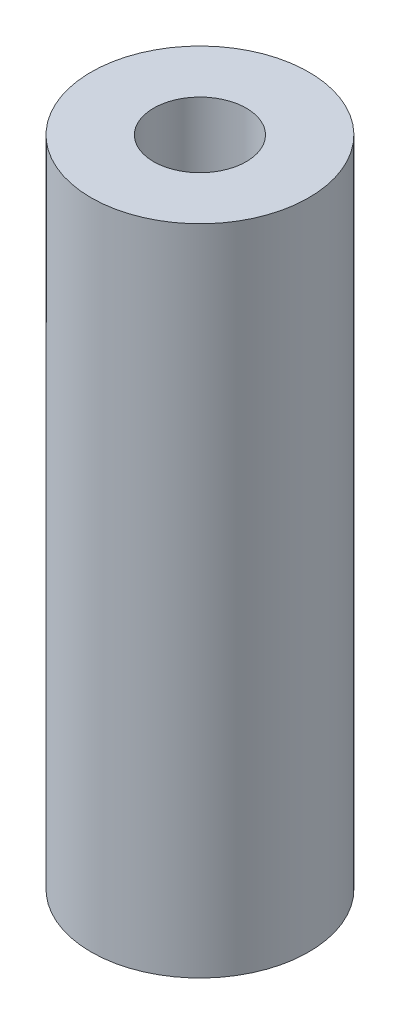
ISO-10303-21;
HEADER;
FILE_DESCRIPTION(('STEP AP214'),'2;1');
FILE_NAME('part.step','',(''),(''),'','','');
FILE_SCHEMA(('AUTOMOTIVE_DESIGN { 1 0 10303 214 1 1 1 1 }'));
ENDSEC;
DATA;
#1=APPLICATION_CONTEXT('core data for automotive mechanical design processes');
#2=APPLICATION_PROTOCOL_DEFINITION('international standard','automotive_design',2000,#1);
#3=PRODUCT_CONTEXT('',#1,'mechanical');
#4=PRODUCT('Part','Part','',(#3));
#5=PRODUCT_RELATED_PRODUCT_CATEGORY('part','',(#4));
#6=PRODUCT_DEFINITION_FORMATION('','',#4);
#7=PRODUCT_DEFINITION_CONTEXT('part definition',#1,'design');
#8=PRODUCT_DEFINITION('design','',#6,#7);
#9=PRODUCT_DEFINITION_SHAPE('','',#8);
#10=(LENGTH_UNIT() NAMED_UNIT(*) SI_UNIT(.MILLI.,.METRE.));
#11=(NAMED_UNIT(*) PLANE_ANGLE_UNIT() SI_UNIT($,.RADIAN.));
#12=(NAMED_UNIT(*) SI_UNIT($,.STERADIAN.) SOLID_ANGLE_UNIT());
#13=UNCERTAINTY_MEASURE_WITH_UNIT(LENGTH_MEASURE(1.E-05),#10,'distance_accuracy_value','');
#14=(GEOMETRIC_REPRESENTATION_CONTEXT(3) GLOBAL_UNCERTAINTY_ASSIGNED_CONTEXT((#13)) GLOBAL_UNIT_ASSIGNED_CONTEXT((#10,
#11,#12)) REPRESENTATION_CONTEXT('',''));
#15=CARTESIAN_POINT('',(0.,0.,0.));
#16=DIRECTION('',(0.,0.,1.));
#17=DIRECTION('',(1.,0.,0.));
#18=AXIS2_PLACEMENT_3D('',#15,#16,#17);
#19=CARTESIAN_POINT('',(0.,19.05,0.));
#20=DIRECTION('',(0.,-1.,0.));
#21=DIRECTION('',(0.,0.,-1.));
#22=AXIS2_PLACEMENT_3D('',#19,#20,#21);
#23=CYLINDRICAL_SURFACE('',#22,3.175);
#24=CARTESIAN_POINT('',(0.,19.05,0.));
#25=DIRECTION('',(0.,1.,0.));
#26=DIRECTION('',(0.,0.,1.));
#27=AXIS2_PLACEMENT_3D('',#24,#25,#26);
#28=CIRCLE('',#27,3.175);
#29=CARTESIAN_POINT('',(0.,19.05,3.17500000000001));
#30=VERTEX_POINT('',#29);
#31=EDGE_CURVE('E12',#30,#30,#28,.T.);
#32=ORIENTED_EDGE('',*,*,#31,.F.);
#33=EDGE_LOOP('',(#32));
#34=FACE_BOUND('',#33,.T.);
#35=CARTESIAN_POINT('',(0.,0.,0.));
#36=DIRECTION('',(0.,1.,0.));
#37=DIRECTION('',(0.,0.,1.));
#38=AXIS2_PLACEMENT_3D('',#35,#36,#37);
#39=CIRCLE('',#38,3.175);
#40=CARTESIAN_POINT('',(0.,0.,3.17500000000001));
#41=VERTEX_POINT('',#40);
#42=EDGE_CURVE('E47',#41,#41,#39,.T.);
#43=ORIENTED_EDGE('',*,*,#42,.T.);
#44=EDGE_LOOP('',(#43));
#45=FACE_BOUND('',#44,.T.);
#46=ADVANCED_FACE('F44',(#34,#45),#23,.T.);
#47=CARTESIAN_POINT('',(0.,19.05,0.));
#48=DIRECTION('',(0.,1.,0.));
#49=DIRECTION('',(0.,0.,1.));
#50=AXIS2_PLACEMENT_3D('',#47,#48,#49);
#51=PLANE('',#50);
#52=CARTESIAN_POINT('',(0.,19.05,0.));
#53=DIRECTION('',(0.,1.,0.));
#54=DIRECTION('',(0.,0.,1.));
#55=AXIS2_PLACEMENT_3D('',#52,#53,#54);
#56=CIRCLE('',#55,1.35254999999999);
#57=CARTESIAN_POINT('',(0.,19.05,1.35254999999999));
#58=VERTEX_POINT('',#57);
#59=EDGE_CURVE('E58',#58,#58,#56,.T.);
#60=ORIENTED_EDGE('',*,*,#59,.F.);
#61=EDGE_LOOP('',(#60));
#62=FACE_BOUND('',#61,.T.);
#63=ORIENTED_EDGE('',*,*,#31,.T.);
#64=EDGE_LOOP('',(#63));
#65=FACE_BOUND('',#64,.T.);
#66=ADVANCED_FACE('F64',(#62,#65),#51,.T.);
#67=CARTESIAN_POINT('',(0.,0.,0.));
#68=DIRECTION('',(0.,1.,0.));
#69=DIRECTION('',(0.,0.,1.));
#70=AXIS2_PLACEMENT_3D('',#67,#68,#69);
#71=PLANE('',#70);
#72=CARTESIAN_POINT('',(0.,0.,0.));
#73=DIRECTION('',(0.,1.,0.));
#74=DIRECTION('',(0.,0.,1.));
#75=AXIS2_PLACEMENT_3D('',#72,#73,#74);
#76=CIRCLE('',#75,1.35254999999999);
#77=CARTESIAN_POINT('',(0.,0.,1.35255));
#78=VERTEX_POINT('',#77);
#79=EDGE_CURVE('E54',#78,#78,#76,.T.);
#80=ORIENTED_EDGE('',*,*,#79,.T.);
#81=EDGE_LOOP('',(#80));
#82=FACE_BOUND('',#81,.T.);
#83=ORIENTED_EDGE('',*,*,#42,.F.);
#84=EDGE_LOOP('',(#83));
#85=FACE_BOUND('',#84,.T.);
#86=ADVANCED_FACE('F66',(#82,#85),#71,.F.);
#87=CARTESIAN_POINT('',(0.,19.05,0.));
#88=DIRECTION('',(0.,1.,0.));
#89=DIRECTION('',(0.,0.,1.));
#90=AXIS2_PLACEMENT_3D('',#87,#88,#89);
#91=CYLINDRICAL_SURFACE('',#90,1.35254999999999);
#92=ORIENTED_EDGE('',*,*,#79,.F.);
#93=EDGE_LOOP('',(#92));
#94=FACE_BOUND('',#93,.T.);
#95=ORIENTED_EDGE('',*,*,#59,.T.);
#96=EDGE_LOOP('',(#95));
#97=FACE_BOUND('',#96,.T.);
#98=ADVANCED_FACE('F62',(#94,#97),#91,.F.);
#99=CLOSED_SHELL('',(#46,#66,#86,#98));
#100=MANIFOLD_SOLID_BREP('B2',#99);
#101=ADVANCED_BREP_SHAPE_REPRESENTATION('',(#18,#100),#14);
#102=SHAPE_DEFINITION_REPRESENTATION(#9,#101);
ENDSEC;
END-ISO-10303-21;
